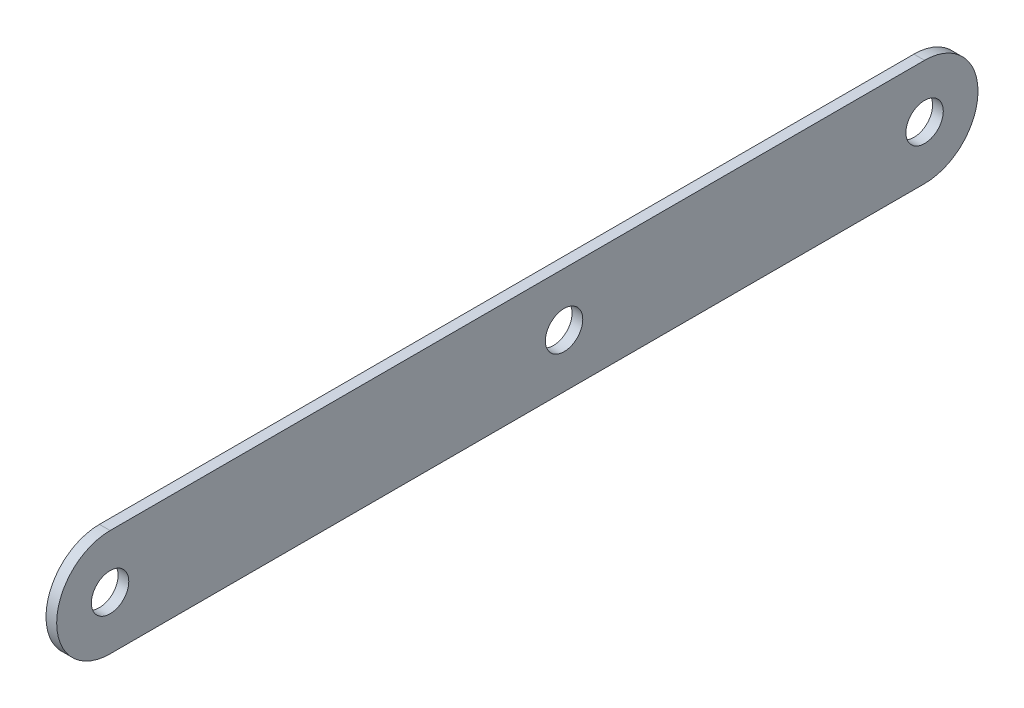
ISO-10303-21;
HEADER;
FILE_DESCRIPTION(('STEP AP214'),'2;1');
FILE_NAME('part.step','',(''),(''),'','','');
FILE_SCHEMA(('AUTOMOTIVE_DESIGN { 1 0 10303 214 1 1 1 1 }'));
ENDSEC;
DATA;
#1=APPLICATION_CONTEXT('core data for automotive mechanical design processes');
#2=APPLICATION_PROTOCOL_DEFINITION('international standard','automotive_design',2000,#1);
#3=PRODUCT_CONTEXT('',#1,'mechanical');
#4=PRODUCT('Part','Part','',(#3));
#5=PRODUCT_RELATED_PRODUCT_CATEGORY('part','',(#4));
#6=PRODUCT_DEFINITION_FORMATION('','',#4);
#7=PRODUCT_DEFINITION_CONTEXT('part definition',#1,'design');
#8=PRODUCT_DEFINITION('design','',#6,#7);
#9=PRODUCT_DEFINITION_SHAPE('','',#8);
#10=(LENGTH_UNIT() NAMED_UNIT(*) SI_UNIT(.MILLI.,.METRE.));
#11=(NAMED_UNIT(*) PLANE_ANGLE_UNIT() SI_UNIT($,.RADIAN.));
#12=(NAMED_UNIT(*) SI_UNIT($,.STERADIAN.) SOLID_ANGLE_UNIT());
#13=UNCERTAINTY_MEASURE_WITH_UNIT(LENGTH_MEASURE(1.E-05),#10,'distance_accuracy_value','');
#14=(GEOMETRIC_REPRESENTATION_CONTEXT(3) GLOBAL_UNCERTAINTY_ASSIGNED_CONTEXT((#13)) GLOBAL_UNIT_ASSIGNED_CONTEXT((#10,
#11,#12)) REPRESENTATION_CONTEXT('',''));
#15=CARTESIAN_POINT('',(0.,0.,0.));
#16=DIRECTION('',(0.,0.,1.));
#17=DIRECTION('',(1.,0.,0.));
#18=AXIS2_PLACEMENT_3D('',#15,#16,#17);
#19=CARTESIAN_POINT('',(-4.,0.,0.));
#20=DIRECTION('',(1.,0.,0.));
#21=DIRECTION('',(0.,0.,-1.));
#22=AXIS2_PLACEMENT_3D('',#19,#20,#21);
#23=CYLINDRICAL_SURFACE('',#22,20.);
#24=CARTESIAN_POINT('',(0.,0.,0.));
#25=DIRECTION('',(1.,0.,0.));
#26=DIRECTION('',(0.,0.,-1.));
#27=AXIS2_PLACEMENT_3D('',#24,#25,#26);
#28=CIRCLE('',#27,20.);
#29=CARTESIAN_POINT('',(0.,20.,0.));
#30=VERTEX_POINT('',#29);
#31=CARTESIAN_POINT('',(0.,-20.,0.));
#32=VERTEX_POINT('',#31);
#33=EDGE_CURVE('E107',#30,#32,#28,.T.);
#34=ORIENTED_EDGE('',*,*,#33,.F.);
#35=DIRECTION('',(1.,0.,0.));
#36=VECTOR('',#35,1.);
#37=CARTESIAN_POINT('',(-4.,20.,0.));
#38=LINE('',#37,#36);
#39=CARTESIAN_POINT('',(-4.,20.,0.));
#40=VERTEX_POINT('',#39);
#41=EDGE_CURVE('E11',#40,#30,#38,.T.);
#42=ORIENTED_EDGE('',*,*,#41,.F.);
#43=CARTESIAN_POINT('',(-4.,0.,0.));
#44=DIRECTION('',(1.,0.,0.));
#45=DIRECTION('',(0.,0.,-1.));
#46=AXIS2_PLACEMENT_3D('',#43,#44,#45);
#47=CIRCLE('',#46,20.);
#48=CARTESIAN_POINT('',(-4.,-20.,0.));
#49=VERTEX_POINT('',#48);
#50=EDGE_CURVE('E100',#40,#49,#47,.T.);
#51=ORIENTED_EDGE('',*,*,#50,.T.);
#52=DIRECTION('',(1.,0.,0.));
#53=VECTOR('',#52,1.);
#54=CARTESIAN_POINT('',(-4.,-20.,0.));
#55=LINE('',#54,#53);
#56=EDGE_CURVE('E45',#49,#32,#55,.T.);
#57=ORIENTED_EDGE('',*,*,#56,.T.);
#58=EDGE_LOOP('',(#34,#42,#51,#57));
#59=FACE_BOUND('',#58,.T.);
#60=ADVANCED_FACE('F42',(#59),#23,.T.);
#61=CARTESIAN_POINT('',(-4.,20.,0.));
#62=DIRECTION('',(0.,1.,0.));
#63=DIRECTION('',(0.,0.,1.));
#64=AXIS2_PLACEMENT_3D('',#61,#62,#63);
#65=PLANE('',#64);
#66=DIRECTION('',(0.,0.,1.));
#67=VECTOR('',#66,1.);
#68=CARTESIAN_POINT('',(0.,20.,0.));
#69=LINE('',#68,#67);
#70=CARTESIAN_POINT('',(0.,20.,-305.));
#71=VERTEX_POINT('',#70);
#72=EDGE_CURVE('E102',#71,#30,#69,.T.);
#73=ORIENTED_EDGE('',*,*,#72,.F.);
#74=DIRECTION('',(1.,0.,0.));
#75=VECTOR('',#74,1.);
#76=CARTESIAN_POINT('',(-4.,20.,-305.));
#77=LINE('',#76,#75);
#78=CARTESIAN_POINT('',(-4.,20.,-305.));
#79=VERTEX_POINT('',#78);
#80=EDGE_CURVE('E51',#79,#71,#77,.T.);
#81=ORIENTED_EDGE('',*,*,#80,.F.);
#82=DIRECTION('',(0.,0.,1.));
#83=VECTOR('',#82,1.);
#84=CARTESIAN_POINT('',(-4.,20.,0.));
#85=LINE('',#84,#83);
#86=EDGE_CURVE('E97',#79,#40,#85,.T.);
#87=ORIENTED_EDGE('',*,*,#86,.T.);
#88=ORIENTED_EDGE('',*,*,#41,.T.);
#89=EDGE_LOOP('',(#73,#81,#87,#88));
#90=FACE_BOUND('',#89,.T.);
#91=ADVANCED_FACE('F118',(#90),#65,.T.);
#92=CARTESIAN_POINT('',(-4.,0.,-305.));
#93=DIRECTION('',(1.,0.,0.));
#94=DIRECTION('',(0.,0.,-1.));
#95=AXIS2_PLACEMENT_3D('',#92,#93,#94);
#96=CYLINDRICAL_SURFACE('',#95,20.);
#97=CARTESIAN_POINT('',(0.,0.,-305.));
#98=DIRECTION('',(1.,0.,0.));
#99=DIRECTION('',(0.,0.,-1.));
#100=AXIS2_PLACEMENT_3D('',#97,#98,#99);
#101=CIRCLE('',#100,20.);
#102=CARTESIAN_POINT('',(0.,-20.,-305.));
#103=VERTEX_POINT('',#102);
#104=EDGE_CURVE('E92',#103,#71,#101,.T.);
#105=ORIENTED_EDGE('',*,*,#104,.F.);
#106=DIRECTION('',(1.,0.,0.));
#107=VECTOR('',#106,1.);
#108=CARTESIAN_POINT('',(-4.,-20.,-305.));
#109=LINE('',#108,#107);
#110=CARTESIAN_POINT('',(-4.,-20.,-305.));
#111=VERTEX_POINT('',#110);
#112=EDGE_CURVE('E87',#111,#103,#109,.T.);
#113=ORIENTED_EDGE('',*,*,#112,.F.);
#114=CARTESIAN_POINT('',(-4.,0.,-305.));
#115=DIRECTION('',(1.,0.,0.));
#116=DIRECTION('',(0.,0.,-1.));
#117=AXIS2_PLACEMENT_3D('',#114,#115,#116);
#118=CIRCLE('',#117,20.);
#119=EDGE_CURVE('E90',#111,#79,#118,.T.);
#120=ORIENTED_EDGE('',*,*,#119,.T.);
#121=ORIENTED_EDGE('',*,*,#80,.T.);
#122=EDGE_LOOP('',(#105,#113,#120,#121));
#123=FACE_BOUND('',#122,.T.);
#124=ADVANCED_FACE('F89',(#123),#96,.T.);
#125=CARTESIAN_POINT('',(-4.,-20.,0.));
#126=DIRECTION('',(0.,-1.,0.));
#127=DIRECTION('',(0.,0.,-1.));
#128=AXIS2_PLACEMENT_3D('',#125,#126,#127);
#129=PLANE('',#128);
#130=DIRECTION('',(0.,0.,-1.));
#131=VECTOR('',#130,1.);
#132=CARTESIAN_POINT('',(0.,-20.,0.));
#133=LINE('',#132,#131);
#134=EDGE_CURVE('E110',#32,#103,#133,.T.);
#135=ORIENTED_EDGE('',*,*,#134,.F.);
#136=ORIENTED_EDGE('',*,*,#56,.F.);
#137=DIRECTION('',(0.,0.,-1.));
#138=VECTOR('',#137,1.);
#139=CARTESIAN_POINT('',(-4.,-20.,0.));
#140=LINE('',#139,#138);
#141=EDGE_CURVE('E96',#49,#111,#140,.T.);
#142=ORIENTED_EDGE('',*,*,#141,.T.);
#143=ORIENTED_EDGE('',*,*,#112,.T.);
#144=EDGE_LOOP('',(#135,#136,#142,#143));
#145=FACE_BOUND('',#144,.T.);
#146=ADVANCED_FACE('F99',(#145),#129,.T.);
#147=CARTESIAN_POINT('',(-4.,0.,0.));
#148=DIRECTION('',(1.,0.,0.));
#149=DIRECTION('',(0.,0.,-1.));
#150=AXIS2_PLACEMENT_3D('',#147,#148,#149);
#151=PLANE('',#150);
#152=CARTESIAN_POINT('',(-4.,0.,-170.));
#153=DIRECTION('',(1.,0.,0.));
#154=DIRECTION('',(0.,0.,-1.));
#155=AXIS2_PLACEMENT_3D('',#152,#153,#154);
#156=CIRCLE('',#155,7.00000000000001);
#157=CARTESIAN_POINT('',(-4.,0.,-177.));
#158=VERTEX_POINT('',#157);
#159=EDGE_CURVE('E155',#158,#158,#156,.T.);
#160=ORIENTED_EDGE('',*,*,#159,.T.);
#161=EDGE_LOOP('',(#160));
#162=FACE_BOUND('',#161,.T.);
#163=CARTESIAN_POINT('',(-4.,0.,-305.));
#164=DIRECTION('',(1.,0.,0.));
#165=DIRECTION('',(0.,0.,-1.));
#166=AXIS2_PLACEMENT_3D('',#163,#164,#165);
#167=CIRCLE('',#166,6.99999999999999);
#168=CARTESIAN_POINT('',(-4.,0.,-312.));
#169=VERTEX_POINT('',#168);
#170=EDGE_CURVE('E163',#169,#169,#167,.T.);
#171=ORIENTED_EDGE('',*,*,#170,.T.);
#172=EDGE_LOOP('',(#171));
#173=FACE_BOUND('',#172,.T.);
#174=CARTESIAN_POINT('',(-4.,0.,0.));
#175=DIRECTION('',(1.,0.,0.));
#176=DIRECTION('',(0.,0.,-1.));
#177=AXIS2_PLACEMENT_3D('',#174,#175,#176);
#178=CIRCLE('',#177,7.);
#179=CARTESIAN_POINT('',(-4.,0.,-7.));
#180=VERTEX_POINT('',#179);
#181=EDGE_CURVE('E111',#180,#180,#178,.T.);
#182=ORIENTED_EDGE('',*,*,#181,.T.);
#183=EDGE_LOOP('',(#182));
#184=FACE_BOUND('',#183,.T.);
#185=ORIENTED_EDGE('',*,*,#50,.F.);
#186=ORIENTED_EDGE('',*,*,#86,.F.);
#187=ORIENTED_EDGE('',*,*,#119,.F.);
#188=ORIENTED_EDGE('',*,*,#141,.F.);
#189=EDGE_LOOP('',(#185,#186,#187,#188));
#190=FACE_BOUND('',#189,.T.);
#191=ADVANCED_FACE('F95',(#162,#173,#184,#190),#151,.F.);
#192=CARTESIAN_POINT('',(0.,0.,0.));
#193=DIRECTION('',(1.,0.,0.));
#194=DIRECTION('',(0.,0.,-1.));
#195=AXIS2_PLACEMENT_3D('',#192,#193,#194);
#196=PLANE('',#195);
#197=CARTESIAN_POINT('',(0.,0.,-170.));
#198=DIRECTION('',(1.,0.,0.));
#199=DIRECTION('',(0.,0.,-1.));
#200=AXIS2_PLACEMENT_3D('',#197,#198,#199);
#201=CIRCLE('',#200,7.00000000000001);
#202=CARTESIAN_POINT('',(0.,0.,-177.));
#203=VERTEX_POINT('',#202);
#204=EDGE_CURVE('E158',#203,#203,#201,.T.);
#205=ORIENTED_EDGE('',*,*,#204,.F.);
#206=EDGE_LOOP('',(#205));
#207=FACE_BOUND('',#206,.T.);
#208=CARTESIAN_POINT('',(0.,0.,-305.));
#209=DIRECTION('',(1.,0.,0.));
#210=DIRECTION('',(0.,0.,-1.));
#211=AXIS2_PLACEMENT_3D('',#208,#209,#210);
#212=CIRCLE('',#211,6.99999999999999);
#213=CARTESIAN_POINT('',(0.,0.,-312.));
#214=VERTEX_POINT('',#213);
#215=EDGE_CURVE('E160',#214,#214,#212,.T.);
#216=ORIENTED_EDGE('',*,*,#215,.F.);
#217=EDGE_LOOP('',(#216));
#218=FACE_BOUND('',#217,.T.);
#219=CARTESIAN_POINT('',(0.,0.,0.));
#220=DIRECTION('',(1.,0.,0.));
#221=DIRECTION('',(0.,0.,-1.));
#222=AXIS2_PLACEMENT_3D('',#219,#220,#221);
#223=CIRCLE('',#222,7.);
#224=CARTESIAN_POINT('',(0.,0.,-7.));
#225=VERTEX_POINT('',#224);
#226=EDGE_CURVE('E166',#225,#225,#223,.T.);
#227=ORIENTED_EDGE('',*,*,#226,.F.);
#228=EDGE_LOOP('',(#227));
#229=FACE_BOUND('',#228,.T.);
#230=ORIENTED_EDGE('',*,*,#33,.T.);
#231=ORIENTED_EDGE('',*,*,#134,.T.);
#232=ORIENTED_EDGE('',*,*,#104,.T.);
#233=ORIENTED_EDGE('',*,*,#72,.T.);
#234=EDGE_LOOP('',(#230,#231,#232,#233));
#235=FACE_BOUND('',#234,.T.);
#236=ADVANCED_FACE('F117',(#207,#218,#229,#235),#196,.T.);
#237=CARTESIAN_POINT('',(-4.,0.,0.));
#238=DIRECTION('',(1.,0.,0.));
#239=DIRECTION('',(0.,0.,-1.));
#240=AXIS2_PLACEMENT_3D('',#237,#238,#239);
#241=CYLINDRICAL_SURFACE('',#240,7.);
#242=ORIENTED_EDGE('',*,*,#181,.F.);
#243=EDGE_LOOP('',(#242));
#244=FACE_BOUND('',#243,.T.);
#245=ORIENTED_EDGE('',*,*,#226,.T.);
#246=EDGE_LOOP('',(#245));
#247=FACE_BOUND('',#246,.T.);
#248=ADVANCED_FACE('F136',(#244,#247),#241,.F.);
#249=CARTESIAN_POINT('',(-4.,0.,-305.));
#250=DIRECTION('',(1.,0.,0.));
#251=DIRECTION('',(0.,0.,-1.));
#252=AXIS2_PLACEMENT_3D('',#249,#250,#251);
#253=CYLINDRICAL_SURFACE('',#252,6.99999999999999);
#254=ORIENTED_EDGE('',*,*,#170,.F.);
#255=EDGE_LOOP('',(#254));
#256=FACE_BOUND('',#255,.T.);
#257=ORIENTED_EDGE('',*,*,#215,.T.);
#258=EDGE_LOOP('',(#257));
#259=FACE_BOUND('',#258,.T.);
#260=ADVANCED_FACE('F143',(#256,#259),#253,.F.);
#261=CARTESIAN_POINT('',(-4.,0.,-170.));
#262=DIRECTION('',(1.,0.,0.));
#263=DIRECTION('',(0.,0.,-1.));
#264=AXIS2_PLACEMENT_3D('',#261,#262,#263);
#265=CYLINDRICAL_SURFACE('',#264,7.00000000000001);
#266=ORIENTED_EDGE('',*,*,#159,.F.);
#267=EDGE_LOOP('',(#266));
#268=FACE_BOUND('',#267,.T.);
#269=ORIENTED_EDGE('',*,*,#204,.T.);
#270=EDGE_LOOP('',(#269));
#271=FACE_BOUND('',#270,.T.);
#272=ADVANCED_FACE('F147',(#268,#271),#265,.F.);
#273=CLOSED_SHELL('',(#60,#91,#124,#146,#191,#236,#248,#260,#272));
#274=MANIFOLD_SOLID_BREP('B2',#273);
#275=ADVANCED_BREP_SHAPE_REPRESENTATION('',(#18,#274),#14);
#276=SHAPE_DEFINITION_REPRESENTATION(#9,#275);
ENDSEC;
END-ISO-10303-21;
